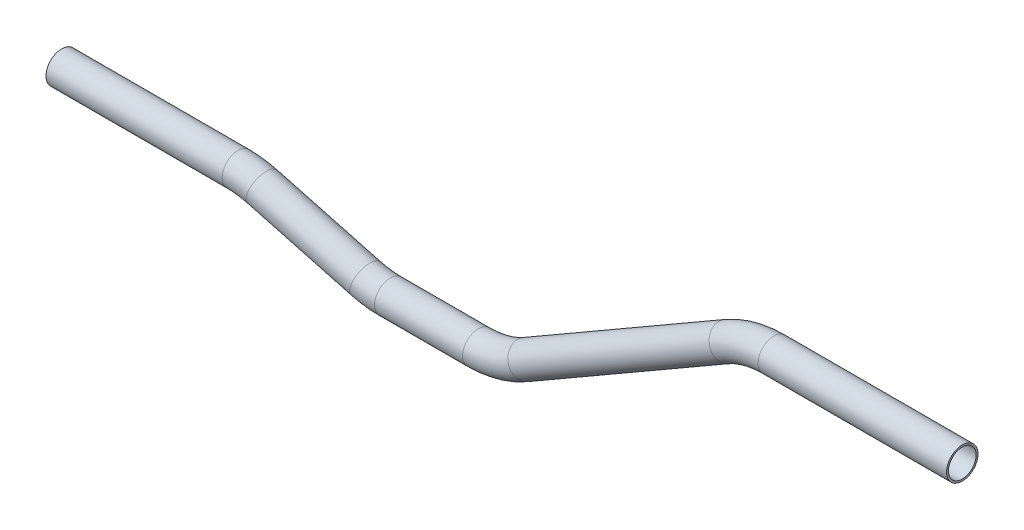
ISO-10303-21;
HEADER;
FILE_DESCRIPTION(('STEP AP214'),'2;1');
FILE_NAME('part.step','',(''),(''),'','','');
FILE_SCHEMA(('AUTOMOTIVE_DESIGN { 1 0 10303 214 1 1 1 1 }'));
ENDSEC;
DATA;
#1=APPLICATION_CONTEXT('core data for automotive mechanical design processes');
#2=APPLICATION_PROTOCOL_DEFINITION('international standard','automotive_design',2000,#1);
#3=PRODUCT_CONTEXT('',#1,'mechanical');
#4=PRODUCT('Part','Part','',(#3));
#5=PRODUCT_RELATED_PRODUCT_CATEGORY('part','',(#4));
#6=PRODUCT_DEFINITION_FORMATION('','',#4);
#7=PRODUCT_DEFINITION_CONTEXT('part definition',#1,'design');
#8=PRODUCT_DEFINITION('design','',#6,#7);
#9=PRODUCT_DEFINITION_SHAPE('','',#8);
#10=(LENGTH_UNIT() NAMED_UNIT(*) SI_UNIT(.MILLI.,.METRE.));
#11=(NAMED_UNIT(*) PLANE_ANGLE_UNIT() SI_UNIT($,.RADIAN.));
#12=(NAMED_UNIT(*) SI_UNIT($,.STERADIAN.) SOLID_ANGLE_UNIT());
#13=UNCERTAINTY_MEASURE_WITH_UNIT(LENGTH_MEASURE(1.E-05),#10,'distance_accuracy_value','');
#14=(GEOMETRIC_REPRESENTATION_CONTEXT(3) GLOBAL_UNCERTAINTY_ASSIGNED_CONTEXT((#13)) GLOBAL_UNIT_ASSIGNED_CONTEXT((#10,
#11,#12)) REPRESENTATION_CONTEXT('',''));
#15=CARTESIAN_POINT('',(0.,0.,0.));
#16=DIRECTION('',(0.,0.,1.));
#17=DIRECTION('',(1.,0.,0.));
#18=AXIS2_PLACEMENT_3D('',#15,#16,#17);
#19=CARTESIAN_POINT('',(-17.5848445631246,20.6509587807314,0.));
#20=DIRECTION('',(1.,0.,0.));
#21=DIRECTION('',(0.,1.,0.));
#22=AXIS2_PLACEMENT_3D('',#19,#20,#21);
#23=CYLINDRICAL_SURFACE('',#22,6.34999999999996);
#24=CARTESIAN_POINT('',(53.5991952787956,20.6509587807315,0.));
#25=DIRECTION('',(1.,0.,0.));
#26=DIRECTION('',(0.,1.,0.));
#27=AXIS2_PLACEMENT_3D('',#24,#25,#26);
#28=CIRCLE('',#27,6.34999999999996);
#29=CARTESIAN_POINT('',(53.5991952787956,27.0009587807314,0.));
#30=VERTEX_POINT('',#29);
#31=EDGE_CURVE('E56',#30,#30,#28,.T.);
#32=ORIENTED_EDGE('',*,*,#31,.F.);
#33=EDGE_LOOP('',(#32));
#34=FACE_BOUND('',#33,.T.);
#35=CARTESIAN_POINT('',(-17.5848445631246,20.6509587807314,0.));
#36=DIRECTION('',(1.,0.,0.));
#37=DIRECTION('',(0.,1.,0.));
#38=AXIS2_PLACEMENT_3D('',#35,#36,#37);
#39=CIRCLE('',#38,6.34999999999996);
#40=CARTESIAN_POINT('',(-17.5848445631246,27.0009587807314,0.));
#41=VERTEX_POINT('',#40);
#42=EDGE_CURVE('E53',#41,#41,#39,.T.);
#43=ORIENTED_EDGE('',*,*,#42,.T.);
#44=EDGE_LOOP('',(#43));
#45=FACE_BOUND('',#44,.T.);
#46=ADVANCED_FACE('F32',(#34,#45),#23,.T.);
#47=CARTESIAN_POINT('',(53.5991952787956,-17.4490412192688,0.));
#48=DIRECTION('',(0.,0.,-1.));
#49=DIRECTION('',(-1.,0.,0.));
#50=AXIS2_PLACEMENT_3D('',#47,#48,#49);
#51=TOROIDAL_SURFACE('',#50,38.1000000000002,6.34999999999996);
#52=CARTESIAN_POINT('',(63.4602008972018,19.3527327623449,0.));
#53=DIRECTION('',(0.965925826289067,-0.258819045102525,0.));
#54=DIRECTION('',(0.258819045102525,0.965925826289067,0.));
#55=AXIS2_PLACEMENT_3D('',#52,#53,#54);
#56=CIRCLE('',#55,6.34999999999996);
#57=CARTESIAN_POINT('',(65.1037018336028,25.4863617592805,0.));
#58=VERTEX_POINT('',#57);
#59=EDGE_CURVE('E59',#58,#58,#56,.T.);
#60=CARTESIAN_POINT('',(53.5991952787956,-17.4490412192688,0.));
#61=DIRECTION('',(0.,0.,-1.));
#62=DIRECTION('',(-1.,0.,0.));
#63=AXIS2_PLACEMENT_3D('',#60,#61,#62);
#64=CIRCLE('',#63,44.4500000000002);
#65=EDGE_CURVE('',#30,#58,#64,.T.);
#66=ORIENTED_EDGE('',*,*,#31,.T.);
#67=ORIENTED_EDGE('',*,*,#59,.F.);
#68=ORIENTED_EDGE('',*,*,#65,.T.);
#69=ORIENTED_EDGE('',*,*,#65,.F.);
#70=EDGE_LOOP('',(#66,#68,#67,#69));
#71=FACE_BOUND('',#70,.T.);
#72=ADVANCED_FACE('F116',(#71),#51,.T.);
#73=CARTESIAN_POINT('',(63.4602008972018,19.3527327623449,0.));
#74=DIRECTION('',(0.965925826289068,-0.258819045102522,0.));
#75=DIRECTION('',(0.258819045102522,0.965925826289068,0.));
#76=AXIS2_PLACEMENT_3D('',#73,#74,#75);
#77=CYLINDRICAL_SURFACE('',#76,6.34999999999996);
#78=CARTESIAN_POINT('',(105.292593550808,8.1437769333495,0.));
#79=DIRECTION('',(0.965925826289067,-0.258819045102525,0.));
#80=DIRECTION('',(0.258819045102525,0.965925826289067,0.));
#81=AXIS2_PLACEMENT_3D('',#78,#79,#80);
#82=CIRCLE('',#81,6.34999999999996);
#83=CARTESIAN_POINT('',(103.649092614407,2.01014793641396,0.));
#84=VERTEX_POINT('',#83);
#85=EDGE_CURVE('E62',#84,#84,#82,.T.);
#86=ORIENTED_EDGE('',*,*,#85,.F.);
#87=EDGE_LOOP('',(#86));
#88=FACE_BOUND('',#87,.T.);
#89=ORIENTED_EDGE('',*,*,#59,.T.);
#90=EDGE_LOOP('',(#89));
#91=FACE_BOUND('',#90,.T.);
#92=ADVANCED_FACE('F120',(#88,#91),#77,.T.);
#93=CARTESIAN_POINT('',(115.153599169214,44.9455509149628,0.));
#94=DIRECTION('',(0.,0.,1.));
#95=DIRECTION('',(1.,0.,0.));
#96=AXIS2_PLACEMENT_3D('',#93,#94,#95);
#97=TOROIDAL_SURFACE('',#96,38.0999999999998,6.34999999999996);
#98=CARTESIAN_POINT('',(115.153599169214,6.84555091496302,0.));
#99=DIRECTION('',(1.,0.,0.));
#100=DIRECTION('',(0.,1.,0.));
#101=AXIS2_PLACEMENT_3D('',#98,#99,#100);
#102=CIRCLE('',#101,6.34999999999996);
#103=CARTESIAN_POINT('',(115.153599169214,0.495550914963061,0.));
#104=VERTEX_POINT('',#103);
#105=EDGE_CURVE('E65',#104,#104,#102,.T.);
#106=CARTESIAN_POINT('',(115.153599169214,44.9455509149628,0.));
#107=DIRECTION('',(0.,0.,1.));
#108=DIRECTION('',(1.,0.,0.));
#109=AXIS2_PLACEMENT_3D('',#106,#107,#108);
#110=CIRCLE('',#109,44.4499999999997);
#111=EDGE_CURVE('',#84,#104,#110,.T.);
#112=ORIENTED_EDGE('',*,*,#85,.T.);
#113=ORIENTED_EDGE('',*,*,#105,.F.);
#114=ORIENTED_EDGE('',*,*,#111,.T.);
#115=ORIENTED_EDGE('',*,*,#111,.F.);
#116=EDGE_LOOP('',(#112,#114,#113,#115));
#117=FACE_BOUND('',#116,.T.);
#118=ADVANCED_FACE('F124',(#117),#97,.T.);
#119=CARTESIAN_POINT('',(115.153599169214,6.845550914963,0.));
#120=DIRECTION('',(1.,0.,0.));
#121=DIRECTION('',(0.,1.,0.));
#122=AXIS2_PLACEMENT_3D('',#119,#120,#121);
#123=CYLINDRICAL_SURFACE('',#122,6.34999999999996);
#124=CARTESIAN_POINT('',(150.728774779508,6.84555091496297,0.));
#125=DIRECTION('',(1.,0.,0.));
#126=DIRECTION('',(0.,1.,0.));
#127=AXIS2_PLACEMENT_3D('',#124,#125,#126);
#128=CIRCLE('',#127,6.34999999999996);
#129=CARTESIAN_POINT('',(150.728774779508,0.49555091496304,0.));
#130=VERTEX_POINT('',#129);
#131=EDGE_CURVE('E68',#130,#130,#128,.T.);
#132=ORIENTED_EDGE('',*,*,#131,.F.);
#133=EDGE_LOOP('',(#132));
#134=FACE_BOUND('',#133,.T.);
#135=ORIENTED_EDGE('',*,*,#105,.T.);
#136=EDGE_LOOP('',(#135));
#137=FACE_BOUND('',#136,.T.);
#138=ADVANCED_FACE('F128',(#134,#137),#123,.T.);
#139=CARTESIAN_POINT('',(150.728774779508,44.9455509149628,0.));
#140=DIRECTION('',(0.,0.,1.));
#141=DIRECTION('',(1.,0.,0.));
#142=AXIS2_PLACEMENT_3D('',#139,#140,#141);
#143=TOROIDAL_SURFACE('',#142,38.0999999999998,6.34999999999996);
#144=CARTESIAN_POINT('',(169.778774779508,11.9499830307759,0.));
#145=DIRECTION('',(0.866025403784441,0.499999999999996,0.));
#146=DIRECTION('',(-0.499999999999996,0.866025403784441,0.));
#147=AXIS2_PLACEMENT_3D('',#144,#145,#146);
#148=CIRCLE('',#147,6.34999999999996);
#149=CARTESIAN_POINT('',(172.953774779508,6.45072171674471,0.));
#150=VERTEX_POINT('',#149);
#151=EDGE_CURVE('E71',#150,#150,#148,.T.);
#152=CARTESIAN_POINT('',(150.728774779508,44.9455509149628,0.));
#153=DIRECTION('',(0.,0.,1.));
#154=DIRECTION('',(1.,0.,0.));
#155=AXIS2_PLACEMENT_3D('',#152,#153,#154);
#156=CIRCLE('',#155,44.4499999999998);
#157=EDGE_CURVE('',#130,#150,#156,.T.);
#158=ORIENTED_EDGE('',*,*,#131,.T.);
#159=ORIENTED_EDGE('',*,*,#151,.F.);
#160=ORIENTED_EDGE('',*,*,#157,.T.);
#161=ORIENTED_EDGE('',*,*,#157,.F.);
#162=EDGE_LOOP('',(#158,#160,#159,#161));
#163=FACE_BOUND('',#162,.T.);
#164=ADVANCED_FACE('F90',(#163),#143,.T.);
#165=CARTESIAN_POINT('',(169.778774779508,11.9499830307759,0.));
#166=DIRECTION('',(0.866025403784438,0.500000000000001,0.));
#167=DIRECTION('',(-0.500000000000001,0.866025403784438,0.));
#168=AXIS2_PLACEMENT_3D('',#165,#166,#167);
#169=CYLINDRICAL_SURFACE('',#168,6.34999999999996);
#170=CARTESIAN_POINT('',(251.083206895321,58.8911187991502,0.));
#171=DIRECTION('',(0.86602540378444,0.499999999999998,0.));
#172=DIRECTION('',(-0.499999999999998,0.86602540378444,0.));
#173=AXIS2_PLACEMENT_3D('',#170,#171,#172);
#174=CIRCLE('',#173,6.34999999999996);
#175=CARTESIAN_POINT('',(247.908206895321,64.3903801131814,0.));
#176=VERTEX_POINT('',#175);
#177=EDGE_CURVE('E73',#176,#176,#174,.T.);
#178=ORIENTED_EDGE('',*,*,#177,.F.);
#179=EDGE_LOOP('',(#178));
#180=FACE_BOUND('',#179,.T.);
#181=ORIENTED_EDGE('',*,*,#151,.T.);
#182=EDGE_LOOP('',(#181));
#183=FACE_BOUND('',#182,.T.);
#184=ADVANCED_FACE('F83',(#180,#183),#169,.T.);
#185=CARTESIAN_POINT('',(270.133206895321,25.895550914963,0.));
#186=DIRECTION('',(0.,0.,-1.));
#187=DIRECTION('',(-1.,0.,0.));
#188=AXIS2_PLACEMENT_3D('',#185,#186,#187);
#189=TOROIDAL_SURFACE('',#188,38.1000000000002,6.34999999999996);
#190=CARTESIAN_POINT('',(270.133206895321,63.9955509149632,0.));
#191=DIRECTION('',(1.,0.,0.));
#192=DIRECTION('',(0.,1.,0.));
#193=AXIS2_PLACEMENT_3D('',#190,#191,#192);
#194=CIRCLE('',#193,6.34999999999996);
#195=CARTESIAN_POINT('',(270.133206895321,70.3455509149632,0.));
#196=VERTEX_POINT('',#195);
#197=EDGE_CURVE('E36',#196,#196,#194,.T.);
#198=CARTESIAN_POINT('',(270.133206895321,25.895550914963,0.));
#199=DIRECTION('',(0.,0.,-1.));
#200=DIRECTION('',(-1.,0.,0.));
#201=AXIS2_PLACEMENT_3D('',#198,#199,#200);
#202=CIRCLE('',#201,44.4500000000002);
#203=EDGE_CURVE('',#176,#196,#202,.T.);
#204=ORIENTED_EDGE('',*,*,#177,.T.);
#205=ORIENTED_EDGE('',*,*,#197,.F.);
#206=ORIENTED_EDGE('',*,*,#203,.T.);
#207=ORIENTED_EDGE('',*,*,#203,.F.);
#208=EDGE_LOOP('',(#204,#206,#205,#207));
#209=FACE_BOUND('',#208,.T.);
#210=ADVANCED_FACE('F81',(#209),#189,.T.);
#211=CARTESIAN_POINT('',(270.133206895321,63.9955509149632,0.));
#212=DIRECTION('',(1.,0.,0.));
#213=DIRECTION('',(0.,1.,0.));
#214=AXIS2_PLACEMENT_3D('',#211,#212,#213);
#215=CYLINDRICAL_SURFACE('',#214,6.34999999999996);
#216=CARTESIAN_POINT('',(346.284342663695,63.9955509149633,0.));
#217=DIRECTION('',(1.,0.,0.));
#218=DIRECTION('',(0.,1.,0.));
#219=AXIS2_PLACEMENT_3D('',#216,#217,#218);
#220=CIRCLE('',#219,6.34999999999996);
#221=CARTESIAN_POINT('',(346.284342663695,70.3455509149632,0.));
#222=VERTEX_POINT('',#221);
#223=EDGE_CURVE('E49',#222,#222,#220,.T.);
#224=ORIENTED_EDGE('',*,*,#223,.F.);
#225=EDGE_LOOP('',(#224));
#226=FACE_BOUND('',#225,.T.);
#227=ORIENTED_EDGE('',*,*,#197,.T.);
#228=EDGE_LOOP('',(#227));
#229=FACE_BOUND('',#228,.T.);
#230=ADVANCED_FACE('F34',(#226,#229),#215,.T.);
#231=CARTESIAN_POINT('',(-17.5848445631246,20.6509587807314,0.));
#232=DIRECTION('',(1.,0.,0.));
#233=DIRECTION('',(0.,1.,0.));
#234=AXIS2_PLACEMENT_3D('',#231,#232,#233);
#235=PLANE('',#234);
#236=CARTESIAN_POINT('',(-17.5848445631246,20.6509587807314,0.));
#237=DIRECTION('',(1.,0.,0.));
#238=DIRECTION('',(0.,1.,0.));
#239=AXIS2_PLACEMENT_3D('',#236,#237,#238);
#240=CIRCLE('',#239,5.58799999999996);
#241=CARTESIAN_POINT('',(-17.5848445631246,26.2389587807314,0.));
#242=VERTEX_POINT('',#241);
#243=EDGE_CURVE('E52',#242,#242,#240,.F.);
#244=ORIENTED_EDGE('',*,*,#243,.F.);
#245=EDGE_LOOP('',(#244));
#246=FACE_BOUND('',#245,.T.);
#247=ORIENTED_EDGE('',*,*,#42,.F.);
#248=EDGE_LOOP('',(#247));
#249=FACE_BOUND('',#248,.T.);
#250=ADVANCED_FACE('F88',(#246,#249),#235,.F.);
#251=CARTESIAN_POINT('',(346.284342663695,63.9955509149633,0.));
#252=DIRECTION('',(1.,0.,0.));
#253=DIRECTION('',(0.,1.,0.));
#254=AXIS2_PLACEMENT_3D('',#251,#252,#253);
#255=PLANE('',#254);
#256=CARTESIAN_POINT('',(346.284342663695,63.9955509149633,0.));
#257=DIRECTION('',(1.,0.,0.));
#258=DIRECTION('',(0.,1.,0.));
#259=AXIS2_PLACEMENT_3D('',#256,#257,#258);
#260=CIRCLE('',#259,5.58799999999996);
#261=CARTESIAN_POINT('',(346.284342663695,69.5835509149632,0.));
#262=VERTEX_POINT('',#261);
#263=EDGE_CURVE('E10',#262,#262,#260,.F.);
#264=ORIENTED_EDGE('',*,*,#263,.T.);
#265=EDGE_LOOP('',(#264));
#266=FACE_BOUND('',#265,.T.);
#267=ORIENTED_EDGE('',*,*,#223,.T.);
#268=EDGE_LOOP('',(#267));
#269=FACE_BOUND('',#268,.T.);
#270=ADVANCED_FACE('F107',(#266,#269),#255,.T.);
#271=CARTESIAN_POINT('',(-17.5848445631246,20.6509587807314,0.));
#272=DIRECTION('',(1.,0.,0.));
#273=DIRECTION('',(0.,1.,0.));
#274=AXIS2_PLACEMENT_3D('',#271,#272,#273);
#275=CYLINDRICAL_SURFACE('',#274,5.58799999999996);
#276=CARTESIAN_POINT('',(53.5991952787956,20.6509587807315,0.));
#277=DIRECTION('',(1.,0.,0.));
#278=DIRECTION('',(0.,1.,0.));
#279=AXIS2_PLACEMENT_3D('',#276,#277,#278);
#280=CIRCLE('',#279,5.58799999999996);
#281=CARTESIAN_POINT('',(53.5991952787956,26.2389587807314,0.));
#282=VERTEX_POINT('',#281);
#283=EDGE_CURVE('E281',#282,#282,#280,.F.);
#284=ORIENTED_EDGE('',*,*,#283,.F.);
#285=EDGE_LOOP('',(#284));
#286=FACE_BOUND('',#285,.T.);
#287=ORIENTED_EDGE('',*,*,#243,.T.);
#288=EDGE_LOOP('',(#287));
#289=FACE_BOUND('',#288,.T.);
#290=ADVANCED_FACE('F110',(#286,#289),#275,.F.);
#291=CARTESIAN_POINT('',(53.5991952787956,-17.4490412192688,0.));
#292=DIRECTION('',(0.,0.,-1.));
#293=DIRECTION('',(-1.,0.,0.));
#294=AXIS2_PLACEMENT_3D('',#291,#292,#293);
#295=TOROIDAL_SURFACE('',#294,38.1000000000002,5.58799999999996);
#296=CARTESIAN_POINT('',(63.4602008972018,19.3527327623449,0.));
#297=DIRECTION('',(0.965925826289067,-0.258819045102525,0.));
#298=DIRECTION('',(0.258819045102525,0.965925826289067,0.));
#299=AXIS2_PLACEMENT_3D('',#296,#297,#298);
#300=CIRCLE('',#299,5.58799999999996);
#301=CARTESIAN_POINT('',(64.9064817212346,24.7503262796482,0.));
#302=VERTEX_POINT('',#301);
#303=EDGE_CURVE('E278',#302,#302,#300,.F.);
#304=CARTESIAN_POINT('',(53.5991952787956,-17.4490412192688,0.));
#305=DIRECTION('',(0.,0.,-1.));
#306=DIRECTION('',(-1.,0.,0.));
#307=AXIS2_PLACEMENT_3D('',#304,#305,#306);
#308=CIRCLE('',#307,43.6880000000002);
#309=EDGE_CURVE('',#282,#302,#308,.T.);
#310=ORIENTED_EDGE('',*,*,#283,.T.);
#311=ORIENTED_EDGE('',*,*,#303,.F.);
#312=ORIENTED_EDGE('',*,*,#309,.T.);
#313=ORIENTED_EDGE('',*,*,#309,.F.);
#314=EDGE_LOOP('',(#310,#312,#311,#313));
#315=FACE_BOUND('',#314,.T.);
#316=ADVANCED_FACE('F189',(#315),#295,.F.);
#317=CARTESIAN_POINT('',(63.4602008972018,19.3527327623449,0.));
#318=DIRECTION('',(0.965925826289068,-0.258819045102522,0.));
#319=DIRECTION('',(0.258819045102522,0.965925826289068,0.));
#320=AXIS2_PLACEMENT_3D('',#317,#318,#319);
#321=CYLINDRICAL_SURFACE('',#320,5.58799999999996);
#322=CARTESIAN_POINT('',(105.292593550808,8.1437769333495,0.));
#323=DIRECTION('',(0.965925826289067,-0.258819045102525,0.));
#324=DIRECTION('',(0.258819045102525,0.965925826289067,0.));
#325=AXIS2_PLACEMENT_3D('',#322,#323,#324);
#326=CIRCLE('',#325,5.58799999999996);
#327=CARTESIAN_POINT('',(103.846312726775,2.74618341604623,0.));
#328=VERTEX_POINT('',#327);
#329=EDGE_CURVE('E275',#328,#328,#326,.F.);
#330=ORIENTED_EDGE('',*,*,#329,.F.);
#331=EDGE_LOOP('',(#330));
#332=FACE_BOUND('',#331,.T.);
#333=ORIENTED_EDGE('',*,*,#303,.T.);
#334=EDGE_LOOP('',(#333));
#335=FACE_BOUND('',#334,.T.);
#336=ADVANCED_FACE('F199',(#332,#335),#321,.F.);
#337=CARTESIAN_POINT('',(115.153599169214,44.9455509149628,0.));
#338=DIRECTION('',(0.,0.,1.));
#339=DIRECTION('',(1.,0.,0.));
#340=AXIS2_PLACEMENT_3D('',#337,#338,#339);
#341=TOROIDAL_SURFACE('',#340,38.0999999999998,5.58799999999996);
#342=CARTESIAN_POINT('',(115.153599169214,6.84555091496302,0.));
#343=DIRECTION('',(1.,0.,0.));
#344=DIRECTION('',(0.,1.,0.));
#345=AXIS2_PLACEMENT_3D('',#342,#343,#344);
#346=CIRCLE('',#345,5.58799999999996);
#347=CARTESIAN_POINT('',(115.153599169214,1.25755091496306,0.));
#348=VERTEX_POINT('',#347);
#349=EDGE_CURVE('E270',#348,#348,#346,.F.);
#350=CARTESIAN_POINT('',(115.153599169214,44.9455509149628,0.));
#351=DIRECTION('',(0.,0.,1.));
#352=DIRECTION('',(1.,0.,0.));
#353=AXIS2_PLACEMENT_3D('',#350,#351,#352);
#354=CIRCLE('',#353,43.6879999999997);
#355=EDGE_CURVE('',#328,#348,#354,.T.);
#356=ORIENTED_EDGE('',*,*,#329,.T.);
#357=ORIENTED_EDGE('',*,*,#349,.F.);
#358=ORIENTED_EDGE('',*,*,#355,.T.);
#359=ORIENTED_EDGE('',*,*,#355,.F.);
#360=EDGE_LOOP('',(#356,#358,#357,#359));
#361=FACE_BOUND('',#360,.T.);
#362=ADVANCED_FACE('F209',(#361),#341,.F.);
#363=CARTESIAN_POINT('',(115.153599169214,6.845550914963,0.));
#364=DIRECTION('',(1.,0.,0.));
#365=DIRECTION('',(0.,1.,0.));
#366=AXIS2_PLACEMENT_3D('',#363,#364,#365);
#367=CYLINDRICAL_SURFACE('',#366,5.58799999999996);
#368=CARTESIAN_POINT('',(150.728774779508,6.84555091496297,0.));
#369=DIRECTION('',(1.,0.,0.));
#370=DIRECTION('',(0.,1.,0.));
#371=AXIS2_PLACEMENT_3D('',#368,#369,#370);
#372=CIRCLE('',#371,5.58799999999996);
#373=CARTESIAN_POINT('',(150.728774779508,1.25755091496305,0.));
#374=VERTEX_POINT('',#373);
#375=EDGE_CURVE('E267',#374,#374,#372,.F.);
#376=ORIENTED_EDGE('',*,*,#375,.F.);
#377=EDGE_LOOP('',(#376));
#378=FACE_BOUND('',#377,.T.);
#379=ORIENTED_EDGE('',*,*,#349,.T.);
#380=EDGE_LOOP('',(#379));
#381=FACE_BOUND('',#380,.T.);
#382=ADVANCED_FACE('F219',(#378,#381),#367,.F.);
#383=CARTESIAN_POINT('',(150.728774779508,44.9455509149628,0.));
#384=DIRECTION('',(0.,0.,1.));
#385=DIRECTION('',(1.,0.,0.));
#386=AXIS2_PLACEMENT_3D('',#383,#384,#385);
#387=TOROIDAL_SURFACE('',#386,38.0999999999998,5.58799999999996);
#388=CARTESIAN_POINT('',(169.778774779508,11.9499830307759,0.));
#389=DIRECTION('',(0.866025403784441,0.499999999999996,0.));
#390=DIRECTION('',(-0.499999999999996,0.866025403784441,0.));
#391=AXIS2_PLACEMENT_3D('',#388,#389,#390);
#392=CIRCLE('',#391,5.58799999999996);
#393=CARTESIAN_POINT('',(172.572774779508,7.11063307442845,0.));
#394=VERTEX_POINT('',#393);
#395=EDGE_CURVE('E266',#394,#394,#392,.F.);
#396=CARTESIAN_POINT('',(150.728774779508,44.9455509149628,0.));
#397=DIRECTION('',(0.,0.,1.));
#398=DIRECTION('',(1.,0.,0.));
#399=AXIS2_PLACEMENT_3D('',#396,#397,#398);
#400=CIRCLE('',#399,43.6879999999998);
#401=EDGE_CURVE('',#374,#394,#400,.T.);
#402=ORIENTED_EDGE('',*,*,#375,.T.);
#403=ORIENTED_EDGE('',*,*,#395,.F.);
#404=ORIENTED_EDGE('',*,*,#401,.T.);
#405=ORIENTED_EDGE('',*,*,#401,.F.);
#406=EDGE_LOOP('',(#402,#404,#403,#405));
#407=FACE_BOUND('',#406,.T.);
#408=ADVANCED_FACE('F229',(#407),#387,.F.);
#409=CARTESIAN_POINT('',(169.778774779508,11.9499830307759,0.));
#410=DIRECTION('',(0.866025403784438,0.500000000000001,0.));
#411=DIRECTION('',(-0.500000000000001,0.866025403784438,0.));
#412=AXIS2_PLACEMENT_3D('',#409,#410,#411);
#413=CYLINDRICAL_SURFACE('',#412,5.58799999999996);
#414=CARTESIAN_POINT('',(251.083206895321,58.8911187991502,0.));
#415=DIRECTION('',(0.86602540378444,0.499999999999998,0.));
#416=DIRECTION('',(-0.499999999999998,0.86602540378444,0.));
#417=AXIS2_PLACEMENT_3D('',#414,#415,#416);
#418=CIRCLE('',#417,5.58799999999996);
#419=CARTESIAN_POINT('',(248.289206895321,63.7304687554976,0.));
#420=VERTEX_POINT('',#419);
#421=EDGE_CURVE('E45',#420,#420,#418,.F.);
#422=ORIENTED_EDGE('',*,*,#421,.F.);
#423=EDGE_LOOP('',(#422));
#424=FACE_BOUND('',#423,.T.);
#425=ORIENTED_EDGE('',*,*,#395,.T.);
#426=EDGE_LOOP('',(#425));
#427=FACE_BOUND('',#426,.T.);
#428=ADVANCED_FACE('F101',(#424,#427),#413,.F.);
#429=CARTESIAN_POINT('',(270.133206895321,25.895550914963,0.));
#430=DIRECTION('',(0.,0.,-1.));
#431=DIRECTION('',(-1.,0.,0.));
#432=AXIS2_PLACEMENT_3D('',#429,#430,#431);
#433=TOROIDAL_SURFACE('',#432,38.1000000000002,5.58799999999996);
#434=CARTESIAN_POINT('',(270.133206895321,63.9955509149632,0.));
#435=DIRECTION('',(1.,0.,0.));
#436=DIRECTION('',(0.,1.,0.));
#437=AXIS2_PLACEMENT_3D('',#434,#435,#436);
#438=CIRCLE('',#437,5.58799999999996);
#439=CARTESIAN_POINT('',(270.133206895321,69.5835509149632,0.));
#440=VERTEX_POINT('',#439);
#441=EDGE_CURVE('E40',#440,#440,#438,.F.);
#442=CARTESIAN_POINT('',(270.133206895321,25.895550914963,0.));
#443=DIRECTION('',(0.,0.,-1.));
#444=DIRECTION('',(-1.,0.,0.));
#445=AXIS2_PLACEMENT_3D('',#442,#443,#444);
#446=CIRCLE('',#445,43.6880000000002);
#447=EDGE_CURVE('',#420,#440,#446,.T.);
#448=ORIENTED_EDGE('',*,*,#421,.T.);
#449=ORIENTED_EDGE('',*,*,#441,.F.);
#450=ORIENTED_EDGE('',*,*,#447,.T.);
#451=ORIENTED_EDGE('',*,*,#447,.F.);
#452=EDGE_LOOP('',(#448,#450,#449,#451));
#453=FACE_BOUND('',#452,.T.);
#454=ADVANCED_FACE('F95',(#453),#433,.F.);
#455=CARTESIAN_POINT('',(270.133206895321,63.9955509149632,0.));
#456=DIRECTION('',(1.,0.,0.));
#457=DIRECTION('',(0.,1.,0.));
#458=AXIS2_PLACEMENT_3D('',#455,#456,#457);
#459=CYLINDRICAL_SURFACE('',#458,5.58799999999996);
#460=ORIENTED_EDGE('',*,*,#263,.F.);
#461=EDGE_LOOP('',(#460));
#462=FACE_BOUND('',#461,.T.);
#463=ORIENTED_EDGE('',*,*,#441,.T.);
#464=EDGE_LOOP('',(#463));
#465=FACE_BOUND('',#464,.T.);
#466=ADVANCED_FACE('F93',(#462,#465),#459,.F.);
#467=CLOSED_SHELL('',(#46,#72,#92,#118,#138,#164,#184,#210,#230,#250,#270,#290,#316,#336,#362,
#382,#408,#428,#454,#466));
#468=MANIFOLD_SOLID_BREP('B2',#467);
#469=ADVANCED_BREP_SHAPE_REPRESENTATION('',(#18,#468),#14);
#470=SHAPE_DEFINITION_REPRESENTATION(#9,#469);
ENDSEC;
END-ISO-10303-21;
